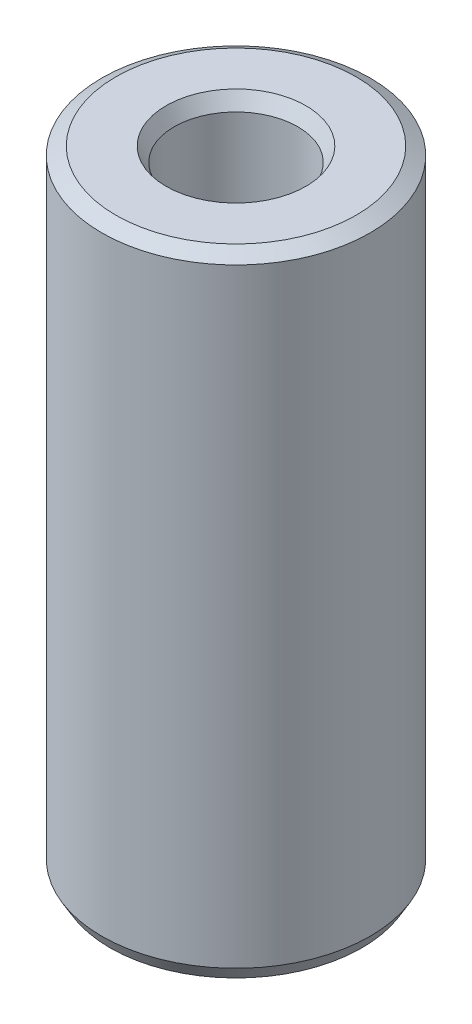
ISO-10303-21;
HEADER;
FILE_DESCRIPTION(('STEP AP214'),'2;1');
FILE_NAME('part.step','',(''),(''),'','','');
FILE_SCHEMA(('AUTOMOTIVE_DESIGN { 1 0 10303 214 1 1 1 1 }'));
ENDSEC;
DATA;
#1=APPLICATION_CONTEXT('core data for automotive mechanical design processes');
#2=APPLICATION_PROTOCOL_DEFINITION('international standard','automotive_design',2000,#1);
#3=PRODUCT_CONTEXT('',#1,'mechanical');
#4=PRODUCT('Part','Part','',(#3));
#5=PRODUCT_RELATED_PRODUCT_CATEGORY('part','',(#4));
#6=PRODUCT_DEFINITION_FORMATION('','',#4);
#7=PRODUCT_DEFINITION_CONTEXT('part definition',#1,'design');
#8=PRODUCT_DEFINITION('design','',#6,#7);
#9=PRODUCT_DEFINITION_SHAPE('','',#8);
#10=(LENGTH_UNIT() NAMED_UNIT(*) SI_UNIT(.MILLI.,.METRE.));
#11=(NAMED_UNIT(*) PLANE_ANGLE_UNIT() SI_UNIT($,.RADIAN.));
#12=(NAMED_UNIT(*) SI_UNIT($,.STERADIAN.) SOLID_ANGLE_UNIT());
#13=UNCERTAINTY_MEASURE_WITH_UNIT(LENGTH_MEASURE(1.E-05),#10,'distance_accuracy_value','');
#14=(GEOMETRIC_REPRESENTATION_CONTEXT(3) GLOBAL_UNCERTAINTY_ASSIGNED_CONTEXT((#13)) GLOBAL_UNIT_ASSIGNED_CONTEXT((#10,
#11,#12)) REPRESENTATION_CONTEXT('',''));
#15=CARTESIAN_POINT('',(0.,0.,0.));
#16=DIRECTION('',(0.,0.,1.));
#17=DIRECTION('',(1.,0.,0.));
#18=AXIS2_PLACEMENT_3D('',#15,#16,#17);
#19=CARTESIAN_POINT('',(0.,188.235904036092,0.));
#20=DIRECTION('',(0.,-1.,0.));
#21=DIRECTION('',(0.,0.,-1.));
#22=AXIS2_PLACEMENT_3D('',#19,#20,#21);
#23=CYLINDRICAL_SURFACE('',#22,40.);
#24=CARTESIAN_POINT('',(0.,4.21734375209989,0.));
#25=DIRECTION('',(0.,1.,0.));
#26=DIRECTION('',(0.,0.,1.));
#27=AXIS2_PLACEMENT_3D('',#24,#25,#26);
#28=CIRCLE('',#27,40.);
#29=CARTESIAN_POINT('',(0.,4.21734375209987,-40.));
#30=VERTEX_POINT('',#29);
#31=EDGE_CURVE('E10',#30,#30,#28,.T.);
#32=CARTESIAN_POINT('',(0.,185.801019485552,0.));
#33=DIRECTION('',(0.,1.,0.));
#34=DIRECTION('',(0.,0.,1.));
#35=AXIS2_PLACEMENT_3D('',#32,#33,#34);
#36=CIRCLE('',#35,40.);
#37=CARTESIAN_POINT('',(0.,185.801019485552,-40.));
#38=VERTEX_POINT('',#37);
#39=EDGE_CURVE('E50',#38,#38,#36,.F.);
#40=CARTESIAN_POINT('',(0.,4.21734375209987,-40.));
#41=CARTESIAN_POINT('',(0.,6.10884037432333,-40.));
#42=CARTESIAN_POINT('',(0.,8.00033699654679,-40.));
#43=CARTESIAN_POINT('',(0.,11.7833302409937,-40.));
#44=CARTESIAN_POINT('',(0.,13.6748268632172,-40.));
#45=CARTESIAN_POINT('',(0.,17.4578201076641,-40.));
#46=CARTESIAN_POINT('',(0.,19.3493167298875,-40.));
#47=CARTESIAN_POINT('',(0.,23.1323099743345,-40.));
#48=CARTESIAN_POINT('',(0.,25.0238065965579,-40.));
#49=CARTESIAN_POINT('',(0.,28.8067998410048,-40.));
#50=CARTESIAN_POINT('',(0.,30.6982964632283,-40.));
#51=CARTESIAN_POINT('',(0.,34.4812897076752,-40.));
#52=CARTESIAN_POINT('',(0.,36.3727863298987,-40.));
#53=CARTESIAN_POINT('',(0.,40.1557795743456,-40.));
#54=CARTESIAN_POINT('',(0.,42.0472761965691,-40.));
#55=CARTESIAN_POINT('',(0.,45.830269441016,-40.));
#56=CARTESIAN_POINT('',(0.,47.7217660632394,-40.));
#57=CARTESIAN_POINT('',(0.,51.5047593076864,-40.));
#58=CARTESIAN_POINT('',(0.,53.3962559299098,-40.));
#59=CARTESIAN_POINT('',(0.,57.1792491743568,-40.));
#60=CARTESIAN_POINT('',(0.,59.0707457965802,-40.));
#61=CARTESIAN_POINT('',(0.,62.8537390410271,-40.));
#62=CARTESIAN_POINT('',(0.,64.7452356632506,-40.));
#63=CARTESIAN_POINT('',(0.,68.5282289076975,-40.));
#64=CARTESIAN_POINT('',(0.,70.419725529921,-40.));
#65=CARTESIAN_POINT('',(0.,74.2027187743679,-40.));
#66=CARTESIAN_POINT('',(0.,76.0942153965914,-40.));
#67=CARTESIAN_POINT('',(0.,79.8772086410383,-40.));
#68=CARTESIAN_POINT('',(0.,81.7687052632617,-40.));
#69=CARTESIAN_POINT('',(0.,85.5516985077087,-40.));
#70=CARTESIAN_POINT('',(0.,87.4431951299321,-40.));
#71=CARTESIAN_POINT('',(0.,91.226188374379,-40.));
#72=CARTESIAN_POINT('',(0.,93.1176849966025,-40.));
#73=CARTESIAN_POINT('',(0.,96.9006782410494,-40.));
#74=CARTESIAN_POINT('',(0.,98.7921748632729,-40.));
#75=CARTESIAN_POINT('',(0.,102.57516810772,-40.));
#76=CARTESIAN_POINT('',(0.,104.466664729943,-40.));
#77=CARTESIAN_POINT('',(0.,108.24965797439,-40.));
#78=CARTESIAN_POINT('',(0.,110.141154596614,-40.));
#79=CARTESIAN_POINT('',(0.,113.924147841061,-40.));
#80=CARTESIAN_POINT('',(0.,115.815644463284,-40.));
#81=CARTESIAN_POINT('',(0.,119.598637707731,-40.));
#82=CARTESIAN_POINT('',(0.,121.490134329954,-40.));
#83=CARTESIAN_POINT('',(0.,125.273127574401,-40.));
#84=CARTESIAN_POINT('',(0.,127.164624196625,-40.));
#85=CARTESIAN_POINT('',(0.,130.947617441072,-40.));
#86=CARTESIAN_POINT('',(0.,132.839114063295,-40.));
#87=CARTESIAN_POINT('',(0.,136.622107307742,-40.));
#88=CARTESIAN_POINT('',(0.,138.513603929966,-40.));
#89=CARTESIAN_POINT('',(0.,142.296597174412,-40.));
#90=CARTESIAN_POINT('',(0.,144.188093796636,-40.));
#91=CARTESIAN_POINT('',(0.,147.971087041083,-40.));
#92=CARTESIAN_POINT('',(0.,149.862583663306,-40.));
#93=CARTESIAN_POINT('',(0.,153.645576907753,-40.));
#94=CARTESIAN_POINT('',(0.,155.537073529977,-40.));
#95=CARTESIAN_POINT('',(0.,159.320066774424,-40.));
#96=CARTESIAN_POINT('',(0.,161.211563396647,-40.));
#97=CARTESIAN_POINT('',(0.,164.994556641094,-40.));
#98=CARTESIAN_POINT('',(0.,166.886053263317,-40.));
#99=CARTESIAN_POINT('',(0.,170.669046507764,-40.));
#100=CARTESIAN_POINT('',(0.,172.560543129988,-40.));
#101=CARTESIAN_POINT('',(0.,176.343536374435,-40.));
#102=CARTESIAN_POINT('',(0.,178.235032996658,-40.));
#103=CARTESIAN_POINT('',(0.,182.018026241105,-40.));
#104=CARTESIAN_POINT('',(0.,183.909522863329,-40.));
#105=CARTESIAN_POINT('',(0.,185.801019485552,-40.));
#106=B_SPLINE_CURVE_WITH_KNOTS('',3,(#40,#41,#42,#43,#44,#45,#46,#47,#48,#49,#50,#51,#52,#53,
#54,#55,#56,#57,#58,#59,#60,#61,#62,#63,#64,#65,#66,#67,#68,#69,#70,#71,#72,#73,#74,#75,#76,#77,
#78,#79,#80,#81,#82,#83,#84,#85,#86,#87,#88,#89,#90,#91,#92,#93,#94,#95,#96,#97,#98,#99,#100,
#101,#102,#103,#104,#105),.UNSPECIFIED.,.F.,.F.,(4,2,2,2,2,2,2,2,2,2,2,2,2,2,2,2,2,2,2,2,2,2,2,
2,2,2,2,2,2,2,2,2,4),(0.,5.67448986667038,11.3489797333408,17.0234696000111,22.6979594666815,
28.3724493333519,34.0469392000223,39.7214290666927,45.395918933363,51.0704088000334,
56.7448986667038,62.4193885333742,68.0938784000446,73.7683682667149,79.4428581333853,
85.1173480000557,90.7918378667261,96.4663277333965,102.140817600067,107.815307466737,
113.489797333408,119.164287200078,124.838777066748,130.513266933419,136.187756800089,
141.86224666676,147.53673653343,153.2112264001,158.885716266771,164.560206133441,
170.234696000111,175.909185866782,181.583675733452),.UNSPECIFIED.);
#107=EDGE_CURVE('BSEAM39',#30,#38,#106,.T.);
#108=ORIENTED_EDGE('',*,*,#31,.T.);
#109=ORIENTED_EDGE('',*,*,#39,.T.);
#110=ORIENTED_EDGE('',*,*,#107,.T.);
#111=ORIENTED_EDGE('',*,*,#107,.F.);
#112=EDGE_LOOP('',(#108,#110,#109,#111));
#113=FACE_BOUND('',#112,.T.);
#114=ADVANCED_FACE('F39',(#113),#23,.T.);
#115=CARTESIAN_POINT('',(0.,188.235904036092,0.));
#116=DIRECTION('',(0.,1.,0.));
#117=DIRECTION('',(0.,0.,1.));
#118=AXIS2_PLACEMENT_3D('',#115,#116,#117);
#119=PLANE('',#118);
#120=CARTESIAN_POINT('',(0.,188.235904036092,0.));
#121=DIRECTION('',(0.,1.,0.));
#122=DIRECTION('',(0.,0.,1.));
#123=AXIS2_PLACEMENT_3D('',#120,#121,#122);
#124=CIRCLE('',#123,20.841451308625);
#125=CARTESIAN_POINT('',(0.,188.235904036092,20.841451308625));
#126=VERTEX_POINT('',#125);
#127=EDGE_CURVE('E58',#126,#126,#124,.F.);
#128=ORIENTED_EDGE('',*,*,#127,.T.);
#129=EDGE_LOOP('',(#128));
#130=FACE_BOUND('',#129,.T.);
#131=CARTESIAN_POINT('',(0.,188.235904036092,0.));
#132=DIRECTION('',(0.,1.,0.));
#133=DIRECTION('',(0.,0.,1.));
#134=AXIS2_PLACEMENT_3D('',#131,#132,#133);
#135=CIRCLE('',#134,35.7826562479006);
#136=CARTESIAN_POINT('',(0.,188.235904036092,35.7826562479006));
#137=VERTEX_POINT('',#136);
#138=EDGE_CURVE('E61',#137,#137,#135,.T.);
#139=ORIENTED_EDGE('',*,*,#138,.T.);
#140=EDGE_LOOP('',(#139));
#141=FACE_BOUND('',#140,.T.);
#142=ADVANCED_FACE('F88',(#130,#141),#119,.T.);
#143=CARTESIAN_POINT('',(0.,0.,0.));
#144=DIRECTION('',(0.,1.,0.));
#145=DIRECTION('',(0.,0.,1.));
#146=AXIS2_PLACEMENT_3D('',#143,#144,#145);
#147=PLANE('',#146);
#148=CARTESIAN_POINT('',(0.,0.,0.));
#149=DIRECTION('',(0.,1.,0.));
#150=DIRECTION('',(0.,0.,1.));
#151=AXIS2_PLACEMENT_3D('',#148,#149,#150);
#152=CIRCLE('',#151,22.6239105101844);
#153=CARTESIAN_POINT('',(0.,0.,22.6239105101844));
#154=VERTEX_POINT('',#153);
#155=EDGE_CURVE('E51',#154,#154,#152,.T.);
#156=ORIENTED_EDGE('',*,*,#155,.T.);
#157=EDGE_LOOP('',(#156));
#158=FACE_BOUND('',#157,.T.);
#159=CARTESIAN_POINT('',(0.,0.,0.));
#160=DIRECTION('',(0.,1.,0.));
#161=DIRECTION('',(0.,0.,1.));
#162=AXIS2_PLACEMENT_3D('',#159,#160,#161);
#163=CIRCLE('',#162,37.5651154494599);
#164=CARTESIAN_POINT('',(0.,0.,37.5651154494599));
#165=VERTEX_POINT('',#164);
#166=EDGE_CURVE('E54',#165,#165,#163,.F.);
#167=ORIENTED_EDGE('',*,*,#166,.T.);
#168=EDGE_LOOP('',(#167));
#169=FACE_BOUND('',#168,.T.);
#170=ADVANCED_FACE('F83',(#158,#169),#147,.F.);
#171=CARTESIAN_POINT('',(0.,188.235904036092,0.));
#172=DIRECTION('',(0.,-1.,0.));
#173=DIRECTION('',(0.,0.,-1.));
#174=AXIS2_PLACEMENT_3D('',#171,#172,#173);
#175=CYLINDRICAL_SURFACE('',#174,18.406566758085);
#176=CARTESIAN_POINT('',(0.,184.018560283992,0.));
#177=DIRECTION('',(0.,1.,0.));
#178=DIRECTION('',(0.,0.,1.));
#179=AXIS2_PLACEMENT_3D('',#176,#177,#178);
#180=CIRCLE('',#179,18.406566758085);
#181=CARTESIAN_POINT('',(0.,184.018560283992,-18.406566758085));
#182=VERTEX_POINT('',#181);
#183=EDGE_CURVE('E67',#182,#182,#180,.T.);
#184=CARTESIAN_POINT('',(0.,2.43488455053983,0.));
#185=DIRECTION('',(0.,1.,0.));
#186=DIRECTION('',(0.,0.,1.));
#187=AXIS2_PLACEMENT_3D('',#184,#185,#186);
#188=CIRCLE('',#187,18.406566758085);
#189=CARTESIAN_POINT('',(0.,2.43488455053981,-18.406566758085));
#190=VERTEX_POINT('',#189);
#191=EDGE_CURVE('E69',#190,#190,#188,.F.);
#192=CARTESIAN_POINT('',(0.,184.018560283992,-18.406566758085));
#193=CARTESIAN_POINT('',(0.,182.127063661769,-18.406566758085));
#194=CARTESIAN_POINT('',(0.,180.235567039545,-18.406566758085));
#195=CARTESIAN_POINT('',(0.,176.452573795098,-18.406566758085));
#196=CARTESIAN_POINT('',(0.,174.561077172875,-18.406566758085));
#197=CARTESIAN_POINT('',(0.,170.778083928428,-18.406566758085));
#198=CARTESIAN_POINT('',(0.,168.886587306204,-18.406566758085));
#199=CARTESIAN_POINT('',(0.,165.103594061757,-18.406566758085));
#200=CARTESIAN_POINT('',(0.,163.212097439534,-18.406566758085));
#201=CARTESIAN_POINT('',(0.,159.429104195087,-18.406566758085));
#202=CARTESIAN_POINT('',(0.,157.537607572864,-18.406566758085));
#203=CARTESIAN_POINT('',(0.,153.754614328417,-18.406566758085));
#204=CARTESIAN_POINT('',(0.,151.863117706193,-18.406566758085));
#205=CARTESIAN_POINT('',(0.,148.080124461746,-18.406566758085));
#206=CARTESIAN_POINT('',(0.,146.188627839523,-18.406566758085));
#207=CARTESIAN_POINT('',(0.,142.405634595076,-18.406566758085));
#208=CARTESIAN_POINT('',(0.,140.514137972852,-18.406566758085));
#209=CARTESIAN_POINT('',(0.,136.731144728406,-18.406566758085));
#210=CARTESIAN_POINT('',(0.,134.839648106182,-18.406566758085));
#211=CARTESIAN_POINT('',(0.,131.056654861735,-18.406566758085));
#212=CARTESIAN_POINT('',(0.,129.165158239512,-18.406566758085));
#213=CARTESIAN_POINT('',(0.,125.382164995065,-18.406566758085));
#214=CARTESIAN_POINT('',(0.,123.490668372841,-18.406566758085));
#215=CARTESIAN_POINT('',(0.,119.707675128394,-18.406566758085));
#216=CARTESIAN_POINT('',(0.,117.816178506171,-18.406566758085));
#217=CARTESIAN_POINT('',(0.,114.033185261724,-18.406566758085));
#218=CARTESIAN_POINT('',(0.,112.141688639501,-18.406566758085));
#219=CARTESIAN_POINT('',(0.,108.358695395054,-18.406566758085));
#220=CARTESIAN_POINT('',(0.,106.46719877283,-18.406566758085));
#221=CARTESIAN_POINT('',(0.,102.684205528383,-18.406566758085));
#222=CARTESIAN_POINT('',(0.,100.79270890616,-18.406566758085));
#223=CARTESIAN_POINT('',(0.,97.0097156617128,-18.406566758085));
#224=CARTESIAN_POINT('',(0.,95.1182190394894,-18.406566758085));
#225=CARTESIAN_POINT('',(0.,91.3352257950425,-18.406566758085));
#226=CARTESIAN_POINT('',(0.,89.443729172819,-18.406566758085));
#227=CARTESIAN_POINT('',(0.,85.6607359283721,-18.406566758085));
#228=CARTESIAN_POINT('',(0.,83.7692393061486,-18.406566758085));
#229=CARTESIAN_POINT('',(0.,79.9862460617017,-18.406566758085));
#230=CARTESIAN_POINT('',(0.,78.0947494394782,-18.406566758085));
#231=CARTESIAN_POINT('',(0.,74.3117561950313,-18.406566758085));
#232=CARTESIAN_POINT('',(0.,72.4202595728079,-18.406566758085));
#233=CARTESIAN_POINT('',(0.,68.6372663283609,-18.406566758085));
#234=CARTESIAN_POINT('',(0.,66.7457697061375,-18.406566758085));
#235=CARTESIAN_POINT('',(0.,62.9627764616906,-18.406566758085));
#236=CARTESIAN_POINT('',(0.,61.0712798394671,-18.406566758085));
#237=CARTESIAN_POINT('',(0.,57.2882865950202,-18.406566758085));
#238=CARTESIAN_POINT('',(0.,55.3967899727967,-18.406566758085));
#239=CARTESIAN_POINT('',(0.,51.6137967283498,-18.406566758085));
#240=CARTESIAN_POINT('',(0.,49.7223001061263,-18.406566758085));
#241=CARTESIAN_POINT('',(0.,45.9393068616794,-18.406566758085));
#242=CARTESIAN_POINT('',(0.,44.0478102394559,-18.406566758085));
#243=CARTESIAN_POINT('',(0.,40.264816995009,-18.406566758085));
#244=CARTESIAN_POINT('',(0.,38.3733203727856,-18.406566758085));
#245=CARTESIAN_POINT('',(0.,34.5903271283387,-18.406566758085));
#246=CARTESIAN_POINT('',(0.,32.6988305061152,-18.406566758085));
#247=CARTESIAN_POINT('',(0.,28.9158372616683,-18.406566758085));
#248=CARTESIAN_POINT('',(0.,27.0243406394448,-18.406566758085));
#249=CARTESIAN_POINT('',(0.,23.2413473949979,-18.406566758085));
#250=CARTESIAN_POINT('',(0.,21.3498507727744,-18.406566758085));
#251=CARTESIAN_POINT('',(0.,17.5668575283275,-18.406566758085));
#252=CARTESIAN_POINT('',(0.,15.675360906104,-18.406566758085));
#253=CARTESIAN_POINT('',(0.,11.8923676616571,-18.406566758085));
#254=CARTESIAN_POINT('',(0.,10.0008710394336,-18.406566758085));
#255=CARTESIAN_POINT('',(0.,6.21787779498673,-18.406566758085));
#256=CARTESIAN_POINT('',(0.,4.32638117276327,-18.406566758085));
#257=CARTESIAN_POINT('',(0.,2.43488455053981,-18.406566758085));
#258=B_SPLINE_CURVE_WITH_KNOTS('',3,(#192,#193,#194,#195,#196,#197,#198,#199,#200,#201,#202,
#203,#204,#205,#206,#207,#208,#209,#210,#211,#212,#213,#214,#215,#216,#217,#218,#219,#220,#221,
#222,#223,#224,#225,#226,#227,#228,#229,#230,#231,#232,#233,#234,#235,#236,#237,#238,#239,#240,
#241,#242,#243,#244,#245,#246,#247,#248,#249,#250,#251,#252,#253,#254,#255,#256,#257),
.UNSPECIFIED.,.F.,.F.,(4,2,2,2,2,2,2,2,2,2,2,2,2,2,2,2,2,2,2,2,2,2,2,2,2,2,2,2,2,2,2,2,4),(0.,
5.67448986667038,11.3489797333408,17.0234696000111,22.6979594666815,28.3724493333519,
34.0469392000223,39.7214290666927,45.395918933363,51.0704088000334,56.7448986667038,
62.4193885333742,68.0938784000446,73.7683682667149,79.4428581333853,85.1173480000557,
90.7918378667261,96.4663277333965,102.140817600067,107.815307466737,113.489797333408,
119.164287200078,124.838777066748,130.513266933419,136.187756800089,141.86224666676,
147.53673653343,153.2112264001,158.885716266771,164.560206133441,170.234696000111,
175.909185866782,181.583675733452),.UNSPECIFIED.);
#259=EDGE_CURVE('BSEAM71',#182,#190,#258,.T.);
#260=ORIENTED_EDGE('',*,*,#183,.T.);
#261=ORIENTED_EDGE('',*,*,#191,.T.);
#262=ORIENTED_EDGE('',*,*,#259,.T.);
#263=ORIENTED_EDGE('',*,*,#259,.F.);
#264=EDGE_LOOP('',(#260,#262,#261,#263));
#265=FACE_BOUND('',#264,.T.);
#266=ADVANCED_FACE('F71',(#265),#175,.F.);
#267=CARTESIAN_POINT('',(0.,184.018560283992,0.));
#268=DIRECTION('',(0.,1.,0.));
#269=DIRECTION('',(0.,0.,1.));
#270=AXIS2_PLACEMENT_3D('',#267,#268,#269);
#271=CONICAL_SURFACE('',#270,18.406566758085,0.523598775598301);
#272=ORIENTED_EDGE('',*,*,#127,.F.);
#273=EDGE_LOOP('',(#272));
#274=FACE_BOUND('',#273,.T.);
#275=ORIENTED_EDGE('',*,*,#183,.F.);
#276=EDGE_LOOP('',(#275));
#277=FACE_BOUND('',#276,.T.);
#278=ADVANCED_FACE('F77',(#274,#277),#271,.F.);
#279=CARTESIAN_POINT('',(0.,0.,0.));
#280=DIRECTION('',(0.,-1.,0.));
#281=DIRECTION('',(0.,0.,-1.));
#282=AXIS2_PLACEMENT_3D('',#279,#280,#281);
#283=CONICAL_SURFACE('',#282,22.6239105101844,1.04719755119659);
#284=ORIENTED_EDGE('',*,*,#191,.F.);
#285=EDGE_LOOP('',(#284));
#286=FACE_BOUND('',#285,.T.);
#287=ORIENTED_EDGE('',*,*,#155,.F.);
#288=EDGE_LOOP('',(#287));
#289=FACE_BOUND('',#288,.T.);
#290=ADVANCED_FACE('F73',(#286,#289),#283,.F.);
#291=CARTESIAN_POINT('',(0.,4.21734375209989,0.));
#292=DIRECTION('',(0.,1.,0.));
#293=DIRECTION('',(0.,0.,1.));
#294=AXIS2_PLACEMENT_3D('',#291,#292,#293);
#295=CONICAL_SURFACE('',#294,40.,0.523598775598303);
#296=ORIENTED_EDGE('',*,*,#166,.F.);
#297=EDGE_LOOP('',(#296));
#298=FACE_BOUND('',#297,.T.);
#299=ORIENTED_EDGE('',*,*,#31,.F.);
#300=EDGE_LOOP('',(#299));
#301=FACE_BOUND('',#300,.T.);
#302=ADVANCED_FACE('F76',(#298,#301),#295,.T.);
#303=CARTESIAN_POINT('',(0.,188.235904036092,0.));
#304=DIRECTION('',(0.,-1.,0.));
#305=DIRECTION('',(0.,0.,-1.));
#306=AXIS2_PLACEMENT_3D('',#303,#304,#305);
#307=CONICAL_SURFACE('',#306,35.7826562479006,1.04719755119659);
#308=ORIENTED_EDGE('',*,*,#39,.F.);
#309=EDGE_LOOP('',(#308));
#310=FACE_BOUND('',#309,.T.);
#311=ORIENTED_EDGE('',*,*,#138,.F.);
#312=EDGE_LOOP('',(#311));
#313=FACE_BOUND('',#312,.T.);
#314=ADVANCED_FACE('F45',(#310,#313),#307,.T.);
#315=CLOSED_SHELL('',(#114,#142,#170,#266,#278,#290,#302,#314));
#316=MANIFOLD_SOLID_BREP('B2',#315);
#317=ADVANCED_BREP_SHAPE_REPRESENTATION('',(#18,#316),#14);
#318=SHAPE_DEFINITION_REPRESENTATION(#9,#317);
ENDSEC;
END-ISO-10303-21;
